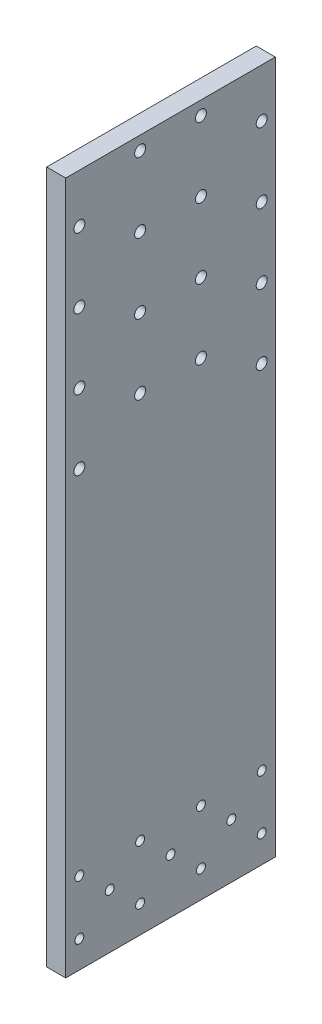
ISO-10303-21;
HEADER;
FILE_DESCRIPTION(('STEP AP214'),'2;1');
FILE_NAME('part.step','',(''),(''),'','','');
FILE_SCHEMA(('AUTOMOTIVE_DESIGN { 1 0 10303 214 1 1 1 1 }'));
ENDSEC;
DATA;
#1=APPLICATION_CONTEXT('core data for automotive mechanical design processes');
#2=APPLICATION_PROTOCOL_DEFINITION('international standard','automotive_design',2000,#1);
#3=PRODUCT_CONTEXT('',#1,'mechanical');
#4=PRODUCT('Part','Part','',(#3));
#5=PRODUCT_RELATED_PRODUCT_CATEGORY('part','',(#4));
#6=PRODUCT_DEFINITION_FORMATION('','',#4);
#7=PRODUCT_DEFINITION_CONTEXT('part definition',#1,'design');
#8=PRODUCT_DEFINITION('design','',#6,#7);
#9=PRODUCT_DEFINITION_SHAPE('','',#8);
#10=(LENGTH_UNIT() NAMED_UNIT(*) SI_UNIT(.MILLI.,.METRE.));
#11=(NAMED_UNIT(*) PLANE_ANGLE_UNIT() SI_UNIT($,.RADIAN.));
#12=(NAMED_UNIT(*) SI_UNIT($,.STERADIAN.) SOLID_ANGLE_UNIT());
#13=UNCERTAINTY_MEASURE_WITH_UNIT(LENGTH_MEASURE(1.E-05),#10,'distance_accuracy_value','');
#14=(GEOMETRIC_REPRESENTATION_CONTEXT(3) GLOBAL_UNCERTAINTY_ASSIGNED_CONTEXT((#13)) GLOBAL_UNIT_ASSIGNED_CONTEXT((#10,
#11,#12)) REPRESENTATION_CONTEXT('',''));
#15=CARTESIAN_POINT('',(0.,0.,0.));
#16=DIRECTION('',(0.,0.,1.));
#17=DIRECTION('',(1.,0.,0.));
#18=AXIS2_PLACEMENT_3D('',#15,#16,#17);
#19=CARTESIAN_POINT('',(-12.5,213.75,-1.27227411932373));
#20=DIRECTION('',(0.,1.,0.));
#21=DIRECTION('',(1.,0.,0.));
#22=AXIS2_PLACEMENT_3D('',#19,#20,#21);
#23=PLANE('',#22);
#24=DIRECTION('',(0.,0.,1.));
#25=VECTOR('',#24,1.);
#26=CARTESIAN_POINT('',(3.5,213.75,0.));
#27=LINE('',#26,#25);
#28=CARTESIAN_POINT('',(3.5,213.75,-38.5));
#29=VERTEX_POINT('',#28);
#30=CARTESIAN_POINT('',(3.5,213.75,38.5));
#31=VERTEX_POINT('',#30);
#32=EDGE_CURVE('E347',#29,#31,#27,.T.);
#33=ORIENTED_EDGE('',*,*,#32,.T.);
#34=DIRECTION('',(-1.,0.,0.));
#35=VECTOR('',#34,1.);
#36=CARTESIAN_POINT('',(3.5,213.75,38.5));
#37=LINE('',#36,#35);
#38=CARTESIAN_POINT('',(-3.5,213.75,38.5));
#39=VERTEX_POINT('',#38);
#40=EDGE_CURVE('E27',#31,#39,#37,.T.);
#41=ORIENTED_EDGE('',*,*,#40,.T.);
#42=DIRECTION('',(0.,0.,1.));
#43=VECTOR('',#42,1.);
#44=CARTESIAN_POINT('',(-3.5,213.75,0.));
#45=LINE('',#44,#43);
#46=CARTESIAN_POINT('',(-3.5,213.75,-38.5));
#47=VERTEX_POINT('',#46);
#48=EDGE_CURVE('E420',#47,#39,#45,.T.);
#49=ORIENTED_EDGE('',*,*,#48,.F.);
#50=DIRECTION('',(1.,0.,0.));
#51=VECTOR('',#50,1.);
#52=CARTESIAN_POINT('',(3.5,213.75,-38.5));
#53=LINE('',#52,#51);
#54=EDGE_CURVE('E11',#47,#29,#53,.T.);
#55=ORIENTED_EDGE('',*,*,#54,.T.);
#56=EDGE_LOOP('',(#33,#41,#49,#55));
#57=FACE_BOUND('',#56,.T.);
#58=ADVANCED_FACE('F16',(#57),#23,.F.);
#59=CARTESIAN_POINT('',(3.5,233.75,-38.5));
#60=DIRECTION('',(0.,0.,-1.));
#61=DIRECTION('',(-1.,0.,0.));
#62=AXIS2_PLACEMENT_3D('',#59,#60,#61);
#63=PLANE('',#62);
#64=ORIENTED_EDGE('',*,*,#54,.F.);
#65=DIRECTION('',(0.,-1.,0.));
#66=VECTOR('',#65,1.);
#67=CARTESIAN_POINT('',(-3.5,233.75,-38.5));
#68=LINE('',#67,#66);
#69=CARTESIAN_POINT('',(-3.5,468.25,-38.5));
#70=VERTEX_POINT('',#69);
#71=EDGE_CURVE('E333',#70,#47,#68,.T.);
#72=ORIENTED_EDGE('',*,*,#71,.F.);
#73=DIRECTION('',(-1.,0.,0.));
#74=VECTOR('',#73,1.);
#75=CARTESIAN_POINT('',(3.5,468.25,-38.5));
#76=LINE('',#75,#74);
#77=CARTESIAN_POINT('',(3.5,468.25,-38.5));
#78=VERTEX_POINT('',#77);
#79=EDGE_CURVE('E329',#78,#70,#76,.T.);
#80=ORIENTED_EDGE('',*,*,#79,.F.);
#81=DIRECTION('',(0.,-1.,0.));
#82=VECTOR('',#81,1.);
#83=CARTESIAN_POINT('',(3.5,233.75,-38.5));
#84=LINE('',#83,#82);
#85=EDGE_CURVE('E312',#78,#29,#84,.T.);
#86=ORIENTED_EDGE('',*,*,#85,.T.);
#87=EDGE_LOOP('',(#64,#72,#80,#86));
#88=FACE_BOUND('',#87,.T.);
#89=ADVANCED_FACE('F424',(#88),#63,.T.);
#90=CARTESIAN_POINT('',(3.5,233.75,38.5));
#91=DIRECTION('',(0.,0.,1.));
#92=DIRECTION('',(1.,0.,0.));
#93=AXIS2_PLACEMENT_3D('',#90,#91,#92);
#94=PLANE('',#93);
#95=ORIENTED_EDGE('',*,*,#40,.F.);
#96=DIRECTION('',(0.,1.,0.));
#97=VECTOR('',#96,1.);
#98=CARTESIAN_POINT('',(3.5,233.75,38.5));
#99=LINE('',#98,#97);
#100=CARTESIAN_POINT('',(3.5,468.25,38.5));
#101=VERTEX_POINT('',#100);
#102=EDGE_CURVE('E309',#31,#101,#99,.T.);
#103=ORIENTED_EDGE('',*,*,#102,.T.);
#104=DIRECTION('',(-1.,0.,0.));
#105=VECTOR('',#104,1.);
#106=CARTESIAN_POINT('',(3.5,468.25,38.5));
#107=LINE('',#106,#105);
#108=CARTESIAN_POINT('',(-3.5,468.25,38.5));
#109=VERTEX_POINT('',#108);
#110=EDGE_CURVE('E368',#101,#109,#107,.T.);
#111=ORIENTED_EDGE('',*,*,#110,.T.);
#112=DIRECTION('',(0.,1.,0.));
#113=VECTOR('',#112,1.);
#114=CARTESIAN_POINT('',(-3.5,233.75,38.5));
#115=LINE('',#114,#113);
#116=EDGE_CURVE('E351',#39,#109,#115,.T.);
#117=ORIENTED_EDGE('',*,*,#116,.F.);
#118=EDGE_LOOP('',(#95,#103,#111,#117));
#119=FACE_BOUND('',#118,.T.);
#120=ADVANCED_FACE('F388',(#119),#94,.T.);
#121=CARTESIAN_POINT('',(3.5,214.875,0.));
#122=DIRECTION('',(1.,0.,0.));
#123=DIRECTION('',(0.,1.,0.));
#124=AXIS2_PLACEMENT_3D('',#121,#122,#123);
#125=PLANE('',#124);
#126=CARTESIAN_POINT('',(3.5,373.25,-33.5));
#127=DIRECTION('',(-1.,0.,0.));
#128=DIRECTION('',(0.,0.,-1.));
#129=AXIS2_PLACEMENT_3D('',#126,#127,#128);
#130=CIRCLE('',#129,2.025);
#131=CARTESIAN_POINT('',(3.5,373.25,-35.525));
#132=VERTEX_POINT('',#131);
#133=EDGE_CURVE('E439',#132,#132,#130,.T.);
#134=ORIENTED_EDGE('',*,*,#133,.T.);
#135=EDGE_LOOP('',(#134));
#136=FACE_BOUND('',#135,.T.);
#137=CARTESIAN_POINT('',(3.5,450.392857142857,33.5));
#138=DIRECTION('',(-1.,0.,0.));
#139=DIRECTION('',(0.,0.,-1.));
#140=AXIS2_PLACEMENT_3D('',#137,#138,#139);
#141=CIRCLE('',#140,2.025);
#142=CARTESIAN_POINT('',(3.5,450.392857142857,31.475));
#143=VERTEX_POINT('',#142);
#144=EDGE_CURVE('E372',#143,#143,#141,.T.);
#145=ORIENTED_EDGE('',*,*,#144,.T.);
#146=EDGE_LOOP('',(#145));
#147=FACE_BOUND('',#146,.T.);
#148=CARTESIAN_POINT('',(3.5,424.678571428572,-33.5));
#149=DIRECTION('',(1.,0.,0.));
#150=DIRECTION('',(0.,0.,-1.));
#151=AXIS2_PLACEMENT_3D('',#148,#149,#150);
#152=CIRCLE('',#151,2.025);
#153=CARTESIAN_POINT('',(3.5,424.678571428572,-35.525));
#154=VERTEX_POINT('',#153);
#155=EDGE_CURVE('E298',#154,#154,#152,.T.);
#156=ORIENTED_EDGE('',*,*,#155,.F.);
#157=EDGE_LOOP('',(#156));
#158=FACE_BOUND('',#157,.T.);
#159=CARTESIAN_POINT('',(3.5,450.392857142857,-33.5));
#160=DIRECTION('',(1.,0.,0.));
#161=DIRECTION('',(0.,0.,-1.));
#162=AXIS2_PLACEMENT_3D('',#159,#160,#161);
#163=CIRCLE('',#162,2.025);
#164=CARTESIAN_POINT('',(3.5,450.392857142857,-35.525));
#165=VERTEX_POINT('',#164);
#166=EDGE_CURVE('E297',#165,#165,#163,.T.);
#167=ORIENTED_EDGE('',*,*,#166,.F.);
#168=EDGE_LOOP('',(#167));
#169=FACE_BOUND('',#168,.T.);
#170=CARTESIAN_POINT('',(3.5,437.535714285715,-11.1666666666667));
#171=DIRECTION('',(-1.,0.,0.));
#172=DIRECTION('',(0.,0.,-1.));
#173=AXIS2_PLACEMENT_3D('',#170,#171,#172);
#174=CIRCLE('',#173,2.025);
#175=CARTESIAN_POINT('',(3.5,437.535714285715,-13.1916666666667));
#176=VERTEX_POINT('',#175);
#177=EDGE_CURVE('E324',#176,#176,#174,.T.);
#178=ORIENTED_EDGE('',*,*,#177,.T.);
#179=EDGE_LOOP('',(#178));
#180=FACE_BOUND('',#179,.T.);
#181=CARTESIAN_POINT('',(3.5,411.821428571429,-11.1666666666667));
#182=DIRECTION('',(1.,0.,0.));
#183=DIRECTION('',(0.,0.,-1.));
#184=AXIS2_PLACEMENT_3D('',#181,#182,#183);
#185=CIRCLE('',#184,2.025);
#186=CARTESIAN_POINT('',(3.5,411.821428571429,-13.1916666666667));
#187=VERTEX_POINT('',#186);
#188=EDGE_CURVE('E261',#187,#187,#185,.T.);
#189=ORIENTED_EDGE('',*,*,#188,.F.);
#190=EDGE_LOOP('',(#189));
#191=FACE_BOUND('',#190,.T.);
#192=CARTESIAN_POINT('',(3.5,386.107142857143,-11.1666666666667));
#193=DIRECTION('',(1.,0.,0.));
#194=DIRECTION('',(0.,0.,-1.));
#195=AXIS2_PLACEMENT_3D('',#192,#193,#194);
#196=CIRCLE('',#195,2.025);
#197=CARTESIAN_POINT('',(3.5,386.107142857143,-13.1916666666667));
#198=VERTEX_POINT('',#197);
#199=EDGE_CURVE('E20',#198,#198,#196,.T.);
#200=ORIENTED_EDGE('',*,*,#199,.F.);
#201=EDGE_LOOP('',(#200));
#202=FACE_BOUND('',#201,.T.);
#203=CARTESIAN_POINT('',(3.5,463.25,11.1666666666667));
#204=DIRECTION('',(1.,0.,0.));
#205=DIRECTION('',(0.,0.,-1.));
#206=AXIS2_PLACEMENT_3D('',#203,#204,#205);
#207=CIRCLE('',#206,2.025);
#208=CARTESIAN_POINT('',(3.5,463.25,9.14166666666666));
#209=VERTEX_POINT('',#208);
#210=EDGE_CURVE('E270',#209,#209,#207,.T.);
#211=ORIENTED_EDGE('',*,*,#210,.F.);
#212=EDGE_LOOP('',(#211));
#213=FACE_BOUND('',#212,.T.);
#214=CARTESIAN_POINT('',(3.5,437.535714285715,11.1666666666667));
#215=DIRECTION('',(1.,0.,0.));
#216=DIRECTION('',(0.,0.,-1.));
#217=AXIS2_PLACEMENT_3D('',#214,#215,#216);
#218=CIRCLE('',#217,2.025);
#219=CARTESIAN_POINT('',(3.5,437.535714285715,9.14166666666666));
#220=VERTEX_POINT('',#219);
#221=EDGE_CURVE('E461',#220,#220,#218,.T.);
#222=ORIENTED_EDGE('',*,*,#221,.F.);
#223=EDGE_LOOP('',(#222));
#224=FACE_BOUND('',#223,.T.);
#225=CARTESIAN_POINT('',(3.5,386.107142857143,11.1666666666667));
#226=DIRECTION('',(-1.,0.,0.));
#227=DIRECTION('',(0.,0.,-1.));
#228=AXIS2_PLACEMENT_3D('',#225,#226,#227);
#229=CIRCLE('',#228,2.025);
#230=CARTESIAN_POINT('',(3.5,386.107142857143,9.14166666666666));
#231=VERTEX_POINT('',#230);
#232=EDGE_CURVE('E299',#231,#231,#229,.T.);
#233=ORIENTED_EDGE('',*,*,#232,.T.);
#234=EDGE_LOOP('',(#233));
#235=FACE_BOUND('',#234,.T.);
#236=CARTESIAN_POINT('',(3.5,411.821428571429,11.1666666666667));
#237=DIRECTION('',(-1.,0.,0.));
#238=DIRECTION('',(0.,0.,-1.));
#239=AXIS2_PLACEMENT_3D('',#236,#237,#238);
#240=CIRCLE('',#239,2.025);
#241=CARTESIAN_POINT('',(3.5,411.821428571429,9.14166666666666));
#242=VERTEX_POINT('',#241);
#243=EDGE_CURVE('E444',#242,#242,#240,.T.);
#244=ORIENTED_EDGE('',*,*,#243,.T.);
#245=EDGE_LOOP('',(#244));
#246=FACE_BOUND('',#245,.T.);
#247=CARTESIAN_POINT('',(3.5,463.25,-11.1666666666667));
#248=DIRECTION('',(-1.,0.,0.));
#249=DIRECTION('',(0.,0.,-1.));
#250=AXIS2_PLACEMENT_3D('',#247,#248,#249);
#251=CIRCLE('',#250,2.025);
#252=CARTESIAN_POINT('',(3.5,463.25,-13.1916666666667));
#253=VERTEX_POINT('',#252);
#254=EDGE_CURVE('E335',#253,#253,#251,.T.);
#255=ORIENTED_EDGE('',*,*,#254,.T.);
#256=EDGE_LOOP('',(#255));
#257=FACE_BOUND('',#256,.T.);
#258=CARTESIAN_POINT('',(3.5,424.678571428572,33.5));
#259=DIRECTION('',(-1.,0.,0.));
#260=DIRECTION('',(0.,0.,-1.));
#261=AXIS2_PLACEMENT_3D('',#258,#259,#260);
#262=CIRCLE('',#261,2.025);
#263=CARTESIAN_POINT('',(3.5,424.678571428572,31.475));
#264=VERTEX_POINT('',#263);
#265=EDGE_CURVE('E183',#264,#264,#262,.T.);
#266=ORIENTED_EDGE('',*,*,#265,.T.);
#267=EDGE_LOOP('',(#266));
#268=FACE_BOUND('',#267,.T.);
#269=CARTESIAN_POINT('',(3.5,398.964285714285,-33.5));
#270=DIRECTION('',(-1.,0.,0.));
#271=DIRECTION('',(0.,0.,-1.));
#272=AXIS2_PLACEMENT_3D('',#269,#270,#271);
#273=CIRCLE('',#272,2.025);
#274=CARTESIAN_POINT('',(3.5,398.964285714285,-35.525));
#275=VERTEX_POINT('',#274);
#276=EDGE_CURVE('E367',#275,#275,#273,.T.);
#277=ORIENTED_EDGE('',*,*,#276,.T.);
#278=EDGE_LOOP('',(#277));
#279=FACE_BOUND('',#278,.T.);
#280=CARTESIAN_POINT('',(3.5,373.25,33.5));
#281=DIRECTION('',(1.,0.,0.));
#282=DIRECTION('',(0.,0.,-1.));
#283=AXIS2_PLACEMENT_3D('',#280,#281,#282);
#284=CIRCLE('',#283,2.025);
#285=CARTESIAN_POINT('',(3.5,373.25,31.475));
#286=VERTEX_POINT('',#285);
#287=EDGE_CURVE('E304',#286,#286,#284,.T.);
#288=ORIENTED_EDGE('',*,*,#287,.F.);
#289=EDGE_LOOP('',(#288));
#290=FACE_BOUND('',#289,.T.);
#291=CARTESIAN_POINT('',(3.5,398.964285714285,33.5));
#292=DIRECTION('',(1.,0.,0.));
#293=DIRECTION('',(0.,0.,-1.));
#294=AXIS2_PLACEMENT_3D('',#291,#292,#293);
#295=CIRCLE('',#294,2.025);
#296=CARTESIAN_POINT('',(3.5,398.964285714285,31.475));
#297=VERTEX_POINT('',#296);
#298=EDGE_CURVE('E315',#297,#297,#295,.T.);
#299=ORIENTED_EDGE('',*,*,#298,.F.);
#300=EDGE_LOOP('',(#299));
#301=FACE_BOUND('',#300,.T.);
#302=CARTESIAN_POINT('',(3.5,233.75,0.));
#303=DIRECTION('',(-1.,0.,0.));
#304=DIRECTION('',(0.,0.,-1.));
#305=AXIS2_PLACEMENT_3D('',#302,#303,#304);
#306=CIRCLE('',#305,1.65);
#307=CARTESIAN_POINT('',(3.5,233.75,-1.65));
#308=VERTEX_POINT('',#307);
#309=EDGE_CURVE('E293',#308,#308,#306,.T.);
#310=ORIENTED_EDGE('',*,*,#309,.T.);
#311=EDGE_LOOP('',(#310));
#312=FACE_BOUND('',#311,.T.);
#313=CARTESIAN_POINT('',(3.5,243.75,-33.5));
#314=DIRECTION('',(-1.,0.,0.));
#315=DIRECTION('',(0.,0.,-1.));
#316=AXIS2_PLACEMENT_3D('',#313,#314,#315);
#317=CIRCLE('',#316,1.65);
#318=CARTESIAN_POINT('',(3.5,243.75,-35.15));
#319=VERTEX_POINT('',#318);
#320=EDGE_CURVE('E292',#319,#319,#317,.T.);
#321=ORIENTED_EDGE('',*,*,#320,.T.);
#322=EDGE_LOOP('',(#321));
#323=FACE_BOUND('',#322,.T.);
#324=CARTESIAN_POINT('',(3.5,243.75,11.1666666666667));
#325=DIRECTION('',(-1.,0.,0.));
#326=DIRECTION('',(0.,0.,-1.));
#327=AXIS2_PLACEMENT_3D('',#324,#325,#326);
#328=CIRCLE('',#327,1.65);
#329=CARTESIAN_POINT('',(3.5,243.75,9.51666666666666));
#330=VERTEX_POINT('',#329);
#331=EDGE_CURVE('E320',#330,#330,#328,.T.);
#332=ORIENTED_EDGE('',*,*,#331,.T.);
#333=EDGE_LOOP('',(#332));
#334=FACE_BOUND('',#333,.T.);
#335=CARTESIAN_POINT('',(3.5,223.75,-33.5));
#336=DIRECTION('',(1.,0.,0.));
#337=DIRECTION('',(0.,0.,-1.));
#338=AXIS2_PLACEMENT_3D('',#335,#336,#337);
#339=CIRCLE('',#338,1.65);
#340=CARTESIAN_POINT('',(3.5,223.75,-35.15));
#341=VERTEX_POINT('',#340);
#342=EDGE_CURVE('E319',#341,#341,#339,.T.);
#343=ORIENTED_EDGE('',*,*,#342,.F.);
#344=EDGE_LOOP('',(#343));
#345=FACE_BOUND('',#344,.T.);
#346=CARTESIAN_POINT('',(3.5,223.75,-11.1666666666667));
#347=DIRECTION('',(1.,0.,0.));
#348=DIRECTION('',(0.,0.,-1.));
#349=AXIS2_PLACEMENT_3D('',#346,#347,#348);
#350=CIRCLE('',#349,1.65);
#351=CARTESIAN_POINT('',(3.5,223.75,-12.8166666666667));
#352=VERTEX_POINT('',#351);
#353=EDGE_CURVE('E275',#352,#352,#350,.T.);
#354=ORIENTED_EDGE('',*,*,#353,.F.);
#355=EDGE_LOOP('',(#354));
#356=FACE_BOUND('',#355,.T.);
#357=CARTESIAN_POINT('',(3.5,223.75,11.1666666666667));
#358=DIRECTION('',(1.,0.,0.));
#359=DIRECTION('',(0.,0.,-1.));
#360=AXIS2_PLACEMENT_3D('',#357,#358,#359);
#361=CIRCLE('',#360,1.65);
#362=CARTESIAN_POINT('',(3.5,223.75,9.51666666666666));
#363=VERTEX_POINT('',#362);
#364=EDGE_CURVE('E274',#363,#363,#361,.T.);
#365=ORIENTED_EDGE('',*,*,#364,.F.);
#366=EDGE_LOOP('',(#365));
#367=FACE_BOUND('',#366,.T.);
#368=CARTESIAN_POINT('',(3.5,223.75,33.5));
#369=DIRECTION('',(1.,0.,0.));
#370=DIRECTION('',(0.,0.,-1.));
#371=AXIS2_PLACEMENT_3D('',#368,#369,#370);
#372=CIRCLE('',#371,1.65);
#373=CARTESIAN_POINT('',(3.5,223.75,31.85));
#374=VERTEX_POINT('',#373);
#375=EDGE_CURVE('E288',#374,#374,#372,.T.);
#376=ORIENTED_EDGE('',*,*,#375,.F.);
#377=EDGE_LOOP('',(#376));
#378=FACE_BOUND('',#377,.T.);
#379=CARTESIAN_POINT('',(3.5,243.75,33.5));
#380=DIRECTION('',(-1.,0.,0.));
#381=DIRECTION('',(0.,0.,-1.));
#382=AXIS2_PLACEMENT_3D('',#379,#380,#381);
#383=CIRCLE('',#382,1.65);
#384=CARTESIAN_POINT('',(3.5,243.75,31.85));
#385=VERTEX_POINT('',#384);
#386=EDGE_CURVE('E283',#385,#385,#383,.T.);
#387=ORIENTED_EDGE('',*,*,#386,.T.);
#388=EDGE_LOOP('',(#387));
#389=FACE_BOUND('',#388,.T.);
#390=CARTESIAN_POINT('',(3.5,243.75,-11.1666666666667));
#391=DIRECTION('',(-1.,0.,0.));
#392=DIRECTION('',(0.,0.,-1.));
#393=AXIS2_PLACEMENT_3D('',#390,#391,#392);
#394=CIRCLE('',#393,1.65);
#395=CARTESIAN_POINT('',(3.5,243.75,-12.8166666666667));
#396=VERTEX_POINT('',#395);
#397=EDGE_CURVE('E282',#396,#396,#394,.T.);
#398=ORIENTED_EDGE('',*,*,#397,.T.);
#399=EDGE_LOOP('',(#398));
#400=FACE_BOUND('',#399,.T.);
#401=CARTESIAN_POINT('',(3.5,233.75,-22.3333333333334));
#402=DIRECTION('',(-1.,0.,0.));
#403=DIRECTION('',(0.,0.,-1.));
#404=AXIS2_PLACEMENT_3D('',#401,#402,#403);
#405=CIRCLE('',#404,1.65);
#406=CARTESIAN_POINT('',(3.5,233.75,-23.9833333333334));
#407=VERTEX_POINT('',#406);
#408=EDGE_CURVE('E246',#407,#407,#405,.T.);
#409=ORIENTED_EDGE('',*,*,#408,.T.);
#410=EDGE_LOOP('',(#409));
#411=FACE_BOUND('',#410,.T.);
#412=CARTESIAN_POINT('',(3.5,233.75,22.3333333333334));
#413=DIRECTION('',(-1.,0.,0.));
#414=DIRECTION('',(0.,0.,-1.));
#415=AXIS2_PLACEMENT_3D('',#412,#413,#414);
#416=CIRCLE('',#415,1.65);
#417=CARTESIAN_POINT('',(3.5,233.75,20.6833333333334));
#418=VERTEX_POINT('',#417);
#419=EDGE_CURVE('E245',#418,#418,#416,.T.);
#420=ORIENTED_EDGE('',*,*,#419,.T.);
#421=EDGE_LOOP('',(#420));
#422=FACE_BOUND('',#421,.T.);
#423=ORIENTED_EDGE('',*,*,#32,.F.);
#424=ORIENTED_EDGE('',*,*,#85,.F.);
#425=DIRECTION('',(0.,0.,-1.));
#426=VECTOR('',#425,1.);
#427=CARTESIAN_POINT('',(3.5,468.25,0.));
#428=LINE('',#427,#426);
#429=EDGE_CURVE('E334',#101,#78,#428,.T.);
#430=ORIENTED_EDGE('',*,*,#429,.F.);
#431=ORIENTED_EDGE('',*,*,#102,.F.);
#432=EDGE_LOOP('',(#423,#424,#430,#431));
#433=FACE_BOUND('',#432,.T.);
#434=ADVANCED_FACE('F385',(#136,#147,#158,#169,#180,#191,#202,#213,#224,#235,#246,#257,#268,
#279,#290,#301,#312,#323,#334,#345,#356,#367,#378,#389,#400,#411,#422,#433),#125,.T.);
#435=CARTESIAN_POINT('',(-3.5,214.875,0.));
#436=DIRECTION('',(1.,0.,0.));
#437=DIRECTION('',(0.,1.,0.));
#438=AXIS2_PLACEMENT_3D('',#435,#436,#437);
#439=PLANE('',#438);
#440=CARTESIAN_POINT('',(-3.5,373.25,-33.5));
#441=DIRECTION('',(-1.,0.,0.));
#442=DIRECTION('',(0.,0.,-1.));
#443=AXIS2_PLACEMENT_3D('',#440,#441,#442);
#444=CIRCLE('',#443,2.025);
#445=CARTESIAN_POINT('',(-3.5,373.25,-35.525));
#446=VERTEX_POINT('',#445);
#447=EDGE_CURVE('E374',#446,#446,#444,.T.);
#448=ORIENTED_EDGE('',*,*,#447,.F.);
#449=EDGE_LOOP('',(#448));
#450=FACE_BOUND('',#449,.T.);
#451=CARTESIAN_POINT('',(-3.5,450.392857142857,33.5));
#452=DIRECTION('',(-1.,0.,0.));
#453=DIRECTION('',(0.,0.,-1.));
#454=AXIS2_PLACEMENT_3D('',#451,#452,#453);
#455=CIRCLE('',#454,2.025);
#456=CARTESIAN_POINT('',(-3.5,450.392857142857,31.475));
#457=VERTEX_POINT('',#456);
#458=EDGE_CURVE('E358',#457,#457,#455,.T.);
#459=ORIENTED_EDGE('',*,*,#458,.F.);
#460=EDGE_LOOP('',(#459));
#461=FACE_BOUND('',#460,.T.);
#462=CARTESIAN_POINT('',(-3.5,424.678571428572,-33.5));
#463=DIRECTION('',(1.,0.,0.));
#464=DIRECTION('',(0.,0.,-1.));
#465=AXIS2_PLACEMENT_3D('',#462,#463,#464);
#466=CIRCLE('',#465,2.025);
#467=CARTESIAN_POINT('',(-3.5,424.678571428572,-35.525));
#468=VERTEX_POINT('',#467);
#469=EDGE_CURVE('E294',#468,#468,#466,.T.);
#470=ORIENTED_EDGE('',*,*,#469,.T.);
#471=EDGE_LOOP('',(#470));
#472=FACE_BOUND('',#471,.T.);
#473=CARTESIAN_POINT('',(-3.5,450.392857142857,-33.5));
#474=DIRECTION('',(1.,0.,0.));
#475=DIRECTION('',(0.,0.,-1.));
#476=AXIS2_PLACEMENT_3D('',#473,#474,#475);
#477=CIRCLE('',#476,2.025);
#478=CARTESIAN_POINT('',(-3.5,450.392857142857,-35.525));
#479=VERTEX_POINT('',#478);
#480=EDGE_CURVE('E321',#479,#479,#477,.T.);
#481=ORIENTED_EDGE('',*,*,#480,.T.);
#482=EDGE_LOOP('',(#481));
#483=FACE_BOUND('',#482,.T.);
#484=CARTESIAN_POINT('',(-3.5,437.535714285715,-11.1666666666667));
#485=DIRECTION('',(-1.,0.,0.));
#486=DIRECTION('',(0.,0.,-1.));
#487=AXIS2_PLACEMENT_3D('',#484,#485,#486);
#488=CIRCLE('',#487,2.025);
#489=CARTESIAN_POINT('',(-3.5,437.535714285715,-13.1916666666667));
#490=VERTEX_POINT('',#489);
#491=EDGE_CURVE('E265',#490,#490,#488,.T.);
#492=ORIENTED_EDGE('',*,*,#491,.F.);
#493=EDGE_LOOP('',(#492));
#494=FACE_BOUND('',#493,.T.);
#495=CARTESIAN_POINT('',(-3.5,411.821428571429,-11.1666666666667));
#496=DIRECTION('',(1.,0.,0.));
#497=DIRECTION('',(0.,0.,-1.));
#498=AXIS2_PLACEMENT_3D('',#495,#496,#497);
#499=CIRCLE('',#498,2.025);
#500=CARTESIAN_POINT('',(-3.5,411.821428571429,-13.1916666666667));
#501=VERTEX_POINT('',#500);
#502=EDGE_CURVE('E264',#501,#501,#499,.T.);
#503=ORIENTED_EDGE('',*,*,#502,.T.);
#504=EDGE_LOOP('',(#503));
#505=FACE_BOUND('',#504,.T.);
#506=CARTESIAN_POINT('',(-3.5,386.107142857143,-11.1666666666667));
#507=DIRECTION('',(1.,0.,0.));
#508=DIRECTION('',(0.,0.,-1.));
#509=AXIS2_PLACEMENT_3D('',#506,#507,#508);
#510=CIRCLE('',#509,2.025);
#511=CARTESIAN_POINT('',(-3.5,386.107142857143,-13.1916666666667));
#512=VERTEX_POINT('',#511);
#513=EDGE_CURVE('E266',#512,#512,#510,.T.);
#514=ORIENTED_EDGE('',*,*,#513,.T.);
#515=EDGE_LOOP('',(#514));
#516=FACE_BOUND('',#515,.T.);
#517=CARTESIAN_POINT('',(-3.5,463.25,11.1666666666667));
#518=DIRECTION('',(1.,0.,0.));
#519=DIRECTION('',(0.,0.,-1.));
#520=AXIS2_PLACEMENT_3D('',#517,#518,#519);
#521=CIRCLE('',#520,2.025);
#522=CARTESIAN_POINT('',(-3.5,463.25,9.14166666666666));
#523=VERTEX_POINT('',#522);
#524=EDGE_CURVE('E354',#523,#523,#521,.T.);
#525=ORIENTED_EDGE('',*,*,#524,.T.);
#526=EDGE_LOOP('',(#525));
#527=FACE_BOUND('',#526,.T.);
#528=CARTESIAN_POINT('',(-3.5,437.535714285715,11.1666666666667));
#529=DIRECTION('',(1.,0.,0.));
#530=DIRECTION('',(0.,0.,-1.));
#531=AXIS2_PLACEMENT_3D('',#528,#529,#530);
#532=CIRCLE('',#531,2.025);
#533=CARTESIAN_POINT('',(-3.5,437.535714285715,9.14166666666666));
#534=VERTEX_POINT('',#533);
#535=EDGE_CURVE('E303',#534,#534,#532,.T.);
#536=ORIENTED_EDGE('',*,*,#535,.T.);
#537=EDGE_LOOP('',(#536));
#538=FACE_BOUND('',#537,.T.);
#539=CARTESIAN_POINT('',(-3.5,386.107142857143,11.1666666666667));
#540=DIRECTION('',(-1.,0.,0.));
#541=DIRECTION('',(0.,0.,-1.));
#542=AXIS2_PLACEMENT_3D('',#539,#540,#541);
#543=CIRCLE('',#542,2.025);
#544=CARTESIAN_POINT('',(-3.5,386.107142857143,9.14166666666666));
#545=VERTEX_POINT('',#544);
#546=EDGE_CURVE('E302',#545,#545,#543,.T.);
#547=ORIENTED_EDGE('',*,*,#546,.F.);
#548=EDGE_LOOP('',(#547));
#549=FACE_BOUND('',#548,.T.);
#550=CARTESIAN_POINT('',(-3.5,411.821428571429,11.1666666666667));
#551=DIRECTION('',(-1.,0.,0.));
#552=DIRECTION('',(0.,0.,-1.));
#553=AXIS2_PLACEMENT_3D('',#550,#551,#552);
#554=CIRCLE('',#553,2.025);
#555=CARTESIAN_POINT('',(-3.5,411.821428571429,9.14166666666666));
#556=VERTEX_POINT('',#555);
#557=EDGE_CURVE('E339',#556,#556,#554,.T.);
#558=ORIENTED_EDGE('',*,*,#557,.F.);
#559=EDGE_LOOP('',(#558));
#560=FACE_BOUND('',#559,.T.);
#561=CARTESIAN_POINT('',(-3.5,463.25,-11.1666666666667));
#562=DIRECTION('',(-1.,0.,0.));
#563=DIRECTION('',(0.,0.,-1.));
#564=AXIS2_PLACEMENT_3D('',#561,#562,#563);
#565=CIRCLE('',#564,2.025);
#566=CARTESIAN_POINT('',(-3.5,463.25,-13.1916666666667));
#567=VERTEX_POINT('',#566);
#568=EDGE_CURVE('E278',#567,#567,#565,.T.);
#569=ORIENTED_EDGE('',*,*,#568,.F.);
#570=EDGE_LOOP('',(#569));
#571=FACE_BOUND('',#570,.T.);
#572=CARTESIAN_POINT('',(-3.5,424.678571428572,33.5));
#573=DIRECTION('',(-1.,0.,0.));
#574=DIRECTION('',(0.,0.,-1.));
#575=AXIS2_PLACEMENT_3D('',#572,#573,#574);
#576=CIRCLE('',#575,2.025);
#577=CARTESIAN_POINT('',(-3.5,424.678571428572,31.475));
#578=VERTEX_POINT('',#577);
#579=EDGE_CURVE('E174',#578,#578,#576,.T.);
#580=ORIENTED_EDGE('',*,*,#579,.F.);
#581=EDGE_LOOP('',(#580));
#582=FACE_BOUND('',#581,.T.);
#583=CARTESIAN_POINT('',(-3.5,398.964285714285,-33.5));
#584=DIRECTION('',(-1.,0.,0.));
#585=DIRECTION('',(0.,0.,-1.));
#586=AXIS2_PLACEMENT_3D('',#583,#584,#585);
#587=CIRCLE('',#586,2.025);
#588=CARTESIAN_POINT('',(-3.5,398.964285714285,-35.525));
#589=VERTEX_POINT('',#588);
#590=EDGE_CURVE('E308',#589,#589,#587,.T.);
#591=ORIENTED_EDGE('',*,*,#590,.F.);
#592=EDGE_LOOP('',(#591));
#593=FACE_BOUND('',#592,.T.);
#594=CARTESIAN_POINT('',(-3.5,373.25,33.5));
#595=DIRECTION('',(1.,0.,0.));
#596=DIRECTION('',(0.,0.,-1.));
#597=AXIS2_PLACEMENT_3D('',#594,#595,#596);
#598=CIRCLE('',#597,2.025);
#599=CARTESIAN_POINT('',(-3.5,373.25,31.475));
#600=VERTEX_POINT('',#599);
#601=EDGE_CURVE('E307',#600,#600,#598,.T.);
#602=ORIENTED_EDGE('',*,*,#601,.T.);
#603=EDGE_LOOP('',(#602));
#604=FACE_BOUND('',#603,.T.);
#605=CARTESIAN_POINT('',(-3.5,398.964285714285,33.5));
#606=DIRECTION('',(1.,0.,0.));
#607=DIRECTION('',(0.,0.,-1.));
#608=AXIS2_PLACEMENT_3D('',#605,#606,#607);
#609=CIRCLE('',#608,2.025);
#610=CARTESIAN_POINT('',(-3.5,398.964285714285,31.475));
#611=VERTEX_POINT('',#610);
#612=EDGE_CURVE('E344',#611,#611,#609,.T.);
#613=ORIENTED_EDGE('',*,*,#612,.T.);
#614=EDGE_LOOP('',(#613));
#615=FACE_BOUND('',#614,.T.);
#616=CARTESIAN_POINT('',(-3.5,233.75,0.));
#617=DIRECTION('',(-1.,0.,0.));
#618=DIRECTION('',(0.,0.,-1.));
#619=AXIS2_PLACEMENT_3D('',#616,#617,#618);
#620=CIRCLE('',#619,1.65);
#621=CARTESIAN_POINT('',(-3.5,233.75,-1.65));
#622=VERTEX_POINT('',#621);
#623=EDGE_CURVE('E289',#622,#622,#620,.T.);
#624=ORIENTED_EDGE('',*,*,#623,.F.);
#625=EDGE_LOOP('',(#624));
#626=FACE_BOUND('',#625,.T.);
#627=CARTESIAN_POINT('',(-3.5,243.75,-33.5));
#628=DIRECTION('',(-1.,0.,0.));
#629=DIRECTION('',(0.,0.,-1.));
#630=AXIS2_PLACEMENT_3D('',#627,#628,#629);
#631=CIRCLE('',#630,1.65);
#632=CARTESIAN_POINT('',(-3.5,243.75,-35.15));
#633=VERTEX_POINT('',#632);
#634=EDGE_CURVE('E450',#633,#633,#631,.T.);
#635=ORIENTED_EDGE('',*,*,#634,.F.);
#636=EDGE_LOOP('',(#635));
#637=FACE_BOUND('',#636,.T.);
#638=CARTESIAN_POINT('',(-3.5,243.75,11.1666666666667));
#639=DIRECTION('',(-1.,0.,0.));
#640=DIRECTION('',(0.,0.,-1.));
#641=AXIS2_PLACEMENT_3D('',#638,#639,#640);
#642=CIRCLE('',#641,1.65);
#643=CARTESIAN_POINT('',(-3.5,243.75,9.51666666666666));
#644=VERTEX_POINT('',#643);
#645=EDGE_CURVE('E316',#644,#644,#642,.T.);
#646=ORIENTED_EDGE('',*,*,#645,.F.);
#647=EDGE_LOOP('',(#646));
#648=FACE_BOUND('',#647,.T.);
#649=CARTESIAN_POINT('',(-3.5,223.75,-33.5));
#650=DIRECTION('',(1.,0.,0.));
#651=DIRECTION('',(0.,0.,-1.));
#652=AXIS2_PLACEMENT_3D('',#649,#650,#651);
#653=CIRCLE('',#652,1.65);
#654=CARTESIAN_POINT('',(-3.5,223.75,-35.15));
#655=VERTEX_POINT('',#654);
#656=EDGE_CURVE('E445',#655,#655,#653,.T.);
#657=ORIENTED_EDGE('',*,*,#656,.T.);
#658=EDGE_LOOP('',(#657));
#659=FACE_BOUND('',#658,.T.);
#660=CARTESIAN_POINT('',(-3.5,223.75,-11.1666666666667));
#661=DIRECTION('',(1.,0.,0.));
#662=DIRECTION('',(0.,0.,-1.));
#663=AXIS2_PLACEMENT_3D('',#660,#661,#662);
#664=CIRCLE('',#663,1.65);
#665=CARTESIAN_POINT('',(-3.5,223.75,-12.8166666666667));
#666=VERTEX_POINT('',#665);
#667=EDGE_CURVE('E271',#666,#666,#664,.T.);
#668=ORIENTED_EDGE('',*,*,#667,.T.);
#669=EDGE_LOOP('',(#668));
#670=FACE_BOUND('',#669,.T.);
#671=CARTESIAN_POINT('',(-3.5,223.75,11.1666666666667));
#672=DIRECTION('',(1.,0.,0.));
#673=DIRECTION('',(0.,0.,-1.));
#674=AXIS2_PLACEMENT_3D('',#671,#672,#673);
#675=CIRCLE('',#674,1.65);
#676=CARTESIAN_POINT('',(-3.5,223.75,9.51666666666666));
#677=VERTEX_POINT('',#676);
#678=EDGE_CURVE('E328',#677,#677,#675,.T.);
#679=ORIENTED_EDGE('',*,*,#678,.T.);
#680=EDGE_LOOP('',(#679));
#681=FACE_BOUND('',#680,.T.);
#682=CARTESIAN_POINT('',(-3.5,223.75,33.5));
#683=DIRECTION('',(1.,0.,0.));
#684=DIRECTION('',(0.,0.,-1.));
#685=AXIS2_PLACEMENT_3D('',#682,#683,#684);
#686=CIRCLE('',#685,1.65);
#687=CARTESIAN_POINT('',(-3.5,223.75,31.85));
#688=VERTEX_POINT('',#687);
#689=EDGE_CURVE('E284',#688,#688,#686,.T.);
#690=ORIENTED_EDGE('',*,*,#689,.T.);
#691=EDGE_LOOP('',(#690));
#692=FACE_BOUND('',#691,.T.);
#693=CARTESIAN_POINT('',(-3.5,243.75,33.5));
#694=DIRECTION('',(-1.,0.,0.));
#695=DIRECTION('',(0.,0.,-1.));
#696=AXIS2_PLACEMENT_3D('',#693,#694,#695);
#697=CIRCLE('',#696,1.65);
#698=CARTESIAN_POINT('',(-3.5,243.75,31.85));
#699=VERTEX_POINT('',#698);
#700=EDGE_CURVE('E279',#699,#699,#697,.T.);
#701=ORIENTED_EDGE('',*,*,#700,.F.);
#702=EDGE_LOOP('',(#701));
#703=FACE_BOUND('',#702,.T.);
#704=CARTESIAN_POINT('',(-3.5,243.75,-11.1666666666667));
#705=DIRECTION('',(-1.,0.,0.));
#706=DIRECTION('',(0.,0.,-1.));
#707=AXIS2_PLACEMENT_3D('',#704,#705,#706);
#708=CIRCLE('',#707,1.65);
#709=CARTESIAN_POINT('',(-3.5,243.75,-12.8166666666667));
#710=VERTEX_POINT('',#709);
#711=EDGE_CURVE('E256',#710,#710,#708,.T.);
#712=ORIENTED_EDGE('',*,*,#711,.F.);
#713=EDGE_LOOP('',(#712));
#714=FACE_BOUND('',#713,.T.);
#715=CARTESIAN_POINT('',(-3.5,233.75,-22.3333333333334));
#716=DIRECTION('',(-1.,0.,0.));
#717=DIRECTION('',(0.,0.,-1.));
#718=AXIS2_PLACEMENT_3D('',#715,#716,#717);
#719=CIRCLE('',#718,1.65);
#720=CARTESIAN_POINT('',(-3.5,233.75,-23.9833333333334));
#721=VERTEX_POINT('',#720);
#722=EDGE_CURVE('E240',#721,#721,#719,.T.);
#723=ORIENTED_EDGE('',*,*,#722,.F.);
#724=EDGE_LOOP('',(#723));
#725=FACE_BOUND('',#724,.T.);
#726=CARTESIAN_POINT('',(-3.5,233.75,22.3333333333334));
#727=DIRECTION('',(-1.,0.,0.));
#728=DIRECTION('',(0.,0.,-1.));
#729=AXIS2_PLACEMENT_3D('',#726,#727,#728);
#730=CIRCLE('',#729,1.65);
#731=CARTESIAN_POINT('',(-3.5,233.75,20.6833333333334));
#732=VERTEX_POINT('',#731);
#733=EDGE_CURVE('E253',#732,#732,#730,.T.);
#734=ORIENTED_EDGE('',*,*,#733,.F.);
#735=EDGE_LOOP('',(#734));
#736=FACE_BOUND('',#735,.T.);
#737=ORIENTED_EDGE('',*,*,#71,.T.);
#738=ORIENTED_EDGE('',*,*,#48,.T.);
#739=ORIENTED_EDGE('',*,*,#116,.T.);
#740=DIRECTION('',(0.,0.,-1.));
#741=VECTOR('',#740,1.);
#742=CARTESIAN_POINT('',(-3.5,468.25,0.));
#743=LINE('',#742,#741);
#744=EDGE_CURVE('E364',#109,#70,#743,.T.);
#745=ORIENTED_EDGE('',*,*,#744,.T.);
#746=EDGE_LOOP('',(#737,#738,#739,#745));
#747=FACE_BOUND('',#746,.T.);
#748=ADVANCED_FACE('F18',(#450,#461,#472,#483,#494,#505,#516,#527,#538,#549,#560,#571,#582,#593,
#604,#615,#626,#637,#648,#659,#670,#681,#692,#703,#714,#725,#736,#747),#439,.F.);
#749=CARTESIAN_POINT('',(3.5,468.25,0.));
#750=DIRECTION('',(0.,1.,0.));
#751=DIRECTION('',(1.,0.,0.));
#752=AXIS2_PLACEMENT_3D('',#749,#750,#751);
#753=PLANE('',#752);
#754=ORIENTED_EDGE('',*,*,#744,.F.);
#755=ORIENTED_EDGE('',*,*,#110,.F.);
#756=ORIENTED_EDGE('',*,*,#429,.T.);
#757=ORIENTED_EDGE('',*,*,#79,.T.);
#758=EDGE_LOOP('',(#754,#755,#756,#757));
#759=FACE_BOUND('',#758,.T.);
#760=ADVANCED_FACE('F581',(#759),#753,.T.);
#761=CARTESIAN_POINT('',(3.5,233.75,22.3333333333334));
#762=DIRECTION('',(-1.,0.,0.));
#763=DIRECTION('',(0.,0.,1.));
#764=AXIS2_PLACEMENT_3D('',#761,#762,#763);
#765=CYLINDRICAL_SURFACE('',#764,1.65);
#766=ORIENTED_EDGE('',*,*,#733,.T.);
#767=EDGE_LOOP('',(#766));
#768=FACE_BOUND('',#767,.T.);
#769=ORIENTED_EDGE('',*,*,#419,.F.);
#770=EDGE_LOOP('',(#769));
#771=FACE_BOUND('',#770,.T.);
#772=ADVANCED_FACE('F580',(#768,#771),#765,.F.);
#773=CARTESIAN_POINT('',(3.5,233.75,-22.3333333333334));
#774=DIRECTION('',(-1.,0.,0.));
#775=DIRECTION('',(0.,0.,1.));
#776=AXIS2_PLACEMENT_3D('',#773,#774,#775);
#777=CYLINDRICAL_SURFACE('',#776,1.65);
#778=ORIENTED_EDGE('',*,*,#722,.T.);
#779=EDGE_LOOP('',(#778));
#780=FACE_BOUND('',#779,.T.);
#781=ORIENTED_EDGE('',*,*,#408,.F.);
#782=EDGE_LOOP('',(#781));
#783=FACE_BOUND('',#782,.T.);
#784=ADVANCED_FACE('F241',(#780,#783),#777,.F.);
#785=CARTESIAN_POINT('',(3.5,243.75,-11.1666666666667));
#786=DIRECTION('',(-1.,0.,0.));
#787=DIRECTION('',(0.,0.,1.));
#788=AXIS2_PLACEMENT_3D('',#785,#786,#787);
#789=CYLINDRICAL_SURFACE('',#788,1.65);
#790=ORIENTED_EDGE('',*,*,#711,.T.);
#791=EDGE_LOOP('',(#790));
#792=FACE_BOUND('',#791,.T.);
#793=ORIENTED_EDGE('',*,*,#397,.F.);
#794=EDGE_LOOP('',(#793));
#795=FACE_BOUND('',#794,.T.);
#796=ADVANCED_FACE('F579',(#792,#795),#789,.F.);
#797=CARTESIAN_POINT('',(3.5,243.75,33.5));
#798=DIRECTION('',(-1.,0.,0.));
#799=DIRECTION('',(0.,0.,1.));
#800=AXIS2_PLACEMENT_3D('',#797,#798,#799);
#801=CYLINDRICAL_SURFACE('',#800,1.65);
#802=ORIENTED_EDGE('',*,*,#700,.T.);
#803=EDGE_LOOP('',(#802));
#804=FACE_BOUND('',#803,.T.);
#805=ORIENTED_EDGE('',*,*,#386,.F.);
#806=EDGE_LOOP('',(#805));
#807=FACE_BOUND('',#806,.T.);
#808=ADVANCED_FACE('F596',(#804,#807),#801,.F.);
#809=CARTESIAN_POINT('',(3.5,223.75,33.5));
#810=DIRECTION('',(-1.,0.,0.));
#811=DIRECTION('',(0.,0.,1.));
#812=AXIS2_PLACEMENT_3D('',#809,#810,#811);
#813=CYLINDRICAL_SURFACE('',#812,1.65);
#814=ORIENTED_EDGE('',*,*,#689,.F.);
#815=EDGE_LOOP('',(#814));
#816=FACE_BOUND('',#815,.T.);
#817=ORIENTED_EDGE('',*,*,#375,.T.);
#818=EDGE_LOOP('',(#817));
#819=FACE_BOUND('',#818,.T.);
#820=ADVANCED_FACE('F570',(#816,#819),#813,.F.);
#821=CARTESIAN_POINT('',(3.5,223.75,11.1666666666667));
#822=DIRECTION('',(-1.,0.,0.));
#823=DIRECTION('',(0.,0.,1.));
#824=AXIS2_PLACEMENT_3D('',#821,#822,#823);
#825=CYLINDRICAL_SURFACE('',#824,1.65);
#826=ORIENTED_EDGE('',*,*,#678,.F.);
#827=EDGE_LOOP('',(#826));
#828=FACE_BOUND('',#827,.T.);
#829=ORIENTED_EDGE('',*,*,#364,.T.);
#830=EDGE_LOOP('',(#829));
#831=FACE_BOUND('',#830,.T.);
#832=ADVANCED_FACE('F566',(#828,#831),#825,.F.);
#833=CARTESIAN_POINT('',(3.5,223.75,-11.1666666666667));
#834=DIRECTION('',(-1.,0.,0.));
#835=DIRECTION('',(0.,0.,1.));
#836=AXIS2_PLACEMENT_3D('',#833,#834,#835);
#837=CYLINDRICAL_SURFACE('',#836,1.65);
#838=ORIENTED_EDGE('',*,*,#667,.F.);
#839=EDGE_LOOP('',(#838));
#840=FACE_BOUND('',#839,.T.);
#841=ORIENTED_EDGE('',*,*,#353,.T.);
#842=EDGE_LOOP('',(#841));
#843=FACE_BOUND('',#842,.T.);
#844=ADVANCED_FACE('F569',(#840,#843),#837,.F.);
#845=CARTESIAN_POINT('',(3.5,223.75,-33.5));
#846=DIRECTION('',(-1.,0.,0.));
#847=DIRECTION('',(0.,0.,1.));
#848=AXIS2_PLACEMENT_3D('',#845,#846,#847);
#849=CYLINDRICAL_SURFACE('',#848,1.65);
#850=ORIENTED_EDGE('',*,*,#656,.F.);
#851=EDGE_LOOP('',(#850));
#852=FACE_BOUND('',#851,.T.);
#853=ORIENTED_EDGE('',*,*,#342,.T.);
#854=EDGE_LOOP('',(#853));
#855=FACE_BOUND('',#854,.T.);
#856=ADVANCED_FACE('F572',(#852,#855),#849,.F.);
#857=CARTESIAN_POINT('',(3.5,243.75,11.1666666666667));
#858=DIRECTION('',(-1.,0.,0.));
#859=DIRECTION('',(0.,0.,1.));
#860=AXIS2_PLACEMENT_3D('',#857,#858,#859);
#861=CYLINDRICAL_SURFACE('',#860,1.65);
#862=ORIENTED_EDGE('',*,*,#645,.T.);
#863=EDGE_LOOP('',(#862));
#864=FACE_BOUND('',#863,.T.);
#865=ORIENTED_EDGE('',*,*,#331,.F.);
#866=EDGE_LOOP('',(#865));
#867=FACE_BOUND('',#866,.T.);
#868=ADVANCED_FACE('F575',(#864,#867),#861,.F.);
#869=CARTESIAN_POINT('',(3.5,243.75,-33.5));
#870=DIRECTION('',(-1.,0.,0.));
#871=DIRECTION('',(0.,0.,1.));
#872=AXIS2_PLACEMENT_3D('',#869,#870,#871);
#873=CYLINDRICAL_SURFACE('',#872,1.65);
#874=ORIENTED_EDGE('',*,*,#634,.T.);
#875=EDGE_LOOP('',(#874));
#876=FACE_BOUND('',#875,.T.);
#877=ORIENTED_EDGE('',*,*,#320,.F.);
#878=EDGE_LOOP('',(#877));
#879=FACE_BOUND('',#878,.T.);
#880=ADVANCED_FACE('F602',(#876,#879),#873,.F.);
#881=CARTESIAN_POINT('',(3.5,233.75,0.));
#882=DIRECTION('',(-1.,0.,0.));
#883=DIRECTION('',(0.,0.,1.));
#884=AXIS2_PLACEMENT_3D('',#881,#882,#883);
#885=CYLINDRICAL_SURFACE('',#884,1.65);
#886=ORIENTED_EDGE('',*,*,#623,.T.);
#887=EDGE_LOOP('',(#886));
#888=FACE_BOUND('',#887,.T.);
#889=ORIENTED_EDGE('',*,*,#309,.F.);
#890=EDGE_LOOP('',(#889));
#891=FACE_BOUND('',#890,.T.);
#892=ADVANCED_FACE('F533',(#888,#891),#885,.F.);
#893=CARTESIAN_POINT('',(3.5,398.964285714285,33.5));
#894=DIRECTION('',(-1.,0.,0.));
#895=DIRECTION('',(0.,0.,1.));
#896=AXIS2_PLACEMENT_3D('',#893,#894,#895);
#897=CYLINDRICAL_SURFACE('',#896,2.025);
#898=ORIENTED_EDGE('',*,*,#612,.F.);
#899=EDGE_LOOP('',(#898));
#900=FACE_BOUND('',#899,.T.);
#901=ORIENTED_EDGE('',*,*,#298,.T.);
#902=EDGE_LOOP('',(#901));
#903=FACE_BOUND('',#902,.T.);
#904=ADVANCED_FACE('F383',(#900,#903),#897,.F.);
#905=CARTESIAN_POINT('',(3.5,373.25,33.5));
#906=DIRECTION('',(-1.,0.,0.));
#907=DIRECTION('',(0.,0.,1.));
#908=AXIS2_PLACEMENT_3D('',#905,#906,#907);
#909=CYLINDRICAL_SURFACE('',#908,2.025);
#910=ORIENTED_EDGE('',*,*,#601,.F.);
#911=EDGE_LOOP('',(#910));
#912=FACE_BOUND('',#911,.T.);
#913=ORIENTED_EDGE('',*,*,#287,.T.);
#914=EDGE_LOOP('',(#913));
#915=FACE_BOUND('',#914,.T.);
#916=ADVANCED_FACE('F521',(#912,#915),#909,.F.);
#917=CARTESIAN_POINT('',(3.5,398.964285714285,-33.5));
#918=DIRECTION('',(-1.,0.,0.));
#919=DIRECTION('',(0.,0.,1.));
#920=AXIS2_PLACEMENT_3D('',#917,#918,#919);
#921=CYLINDRICAL_SURFACE('',#920,2.025);
#922=ORIENTED_EDGE('',*,*,#590,.T.);
#923=EDGE_LOOP('',(#922));
#924=FACE_BOUND('',#923,.T.);
#925=ORIENTED_EDGE('',*,*,#276,.F.);
#926=EDGE_LOOP('',(#925));
#927=FACE_BOUND('',#926,.T.);
#928=ADVANCED_FACE('F523',(#924,#927),#921,.F.);
#929=CARTESIAN_POINT('',(3.5,424.678571428572,33.5));
#930=DIRECTION('',(-1.,0.,0.));
#931=DIRECTION('',(0.,0.,1.));
#932=AXIS2_PLACEMENT_3D('',#929,#930,#931);
#933=CYLINDRICAL_SURFACE('',#932,2.025);
#934=ORIENTED_EDGE('',*,*,#579,.T.);
#935=EDGE_LOOP('',(#934));
#936=FACE_BOUND('',#935,.T.);
#937=ORIENTED_EDGE('',*,*,#265,.F.);
#938=EDGE_LOOP('',(#937));
#939=FACE_BOUND('',#938,.T.);
#940=ADVANCED_FACE('F530',(#936,#939),#933,.F.);
#941=CARTESIAN_POINT('',(3.5,463.25,-11.1666666666667));
#942=DIRECTION('',(-1.,0.,0.));
#943=DIRECTION('',(0.,0.,1.));
#944=AXIS2_PLACEMENT_3D('',#941,#942,#943);
#945=CYLINDRICAL_SURFACE('',#944,2.025);
#946=ORIENTED_EDGE('',*,*,#568,.T.);
#947=EDGE_LOOP('',(#946));
#948=FACE_BOUND('',#947,.T.);
#949=ORIENTED_EDGE('',*,*,#254,.F.);
#950=EDGE_LOOP('',(#949));
#951=FACE_BOUND('',#950,.T.);
#952=ADVANCED_FACE('F592',(#948,#951),#945,.F.);
#953=CARTESIAN_POINT('',(3.5,411.821428571429,11.1666666666667));
#954=DIRECTION('',(-1.,0.,0.));
#955=DIRECTION('',(0.,0.,1.));
#956=AXIS2_PLACEMENT_3D('',#953,#954,#955);
#957=CYLINDRICAL_SURFACE('',#956,2.025);
#958=ORIENTED_EDGE('',*,*,#557,.T.);
#959=EDGE_LOOP('',(#958));
#960=FACE_BOUND('',#959,.T.);
#961=ORIENTED_EDGE('',*,*,#243,.F.);
#962=EDGE_LOOP('',(#961));
#963=FACE_BOUND('',#962,.T.);
#964=ADVANCED_FACE('F563',(#960,#963),#957,.F.);
#965=CARTESIAN_POINT('',(3.5,386.107142857143,11.1666666666667));
#966=DIRECTION('',(-1.,0.,0.));
#967=DIRECTION('',(0.,0.,1.));
#968=AXIS2_PLACEMENT_3D('',#965,#966,#967);
#969=CYLINDRICAL_SURFACE('',#968,2.025);
#970=ORIENTED_EDGE('',*,*,#546,.T.);
#971=EDGE_LOOP('',(#970));
#972=FACE_BOUND('',#971,.T.);
#973=ORIENTED_EDGE('',*,*,#232,.F.);
#974=EDGE_LOOP('',(#973));
#975=FACE_BOUND('',#974,.T.);
#976=ADVANCED_FACE('F506',(#972,#975),#969,.F.);
#977=CARTESIAN_POINT('',(3.5,437.535714285715,11.1666666666667));
#978=DIRECTION('',(-1.,0.,0.));
#979=DIRECTION('',(0.,0.,1.));
#980=AXIS2_PLACEMENT_3D('',#977,#978,#979);
#981=CYLINDRICAL_SURFACE('',#980,2.025);
#982=ORIENTED_EDGE('',*,*,#535,.F.);
#983=EDGE_LOOP('',(#982));
#984=FACE_BOUND('',#983,.T.);
#985=ORIENTED_EDGE('',*,*,#221,.T.);
#986=EDGE_LOOP('',(#985));
#987=FACE_BOUND('',#986,.T.);
#988=ADVANCED_FACE('F502',(#984,#987),#981,.F.);
#989=CARTESIAN_POINT('',(3.5,463.25,11.1666666666667));
#990=DIRECTION('',(-1.,0.,0.));
#991=DIRECTION('',(0.,0.,1.));
#992=AXIS2_PLACEMENT_3D('',#989,#990,#991);
#993=CYLINDRICAL_SURFACE('',#992,2.025);
#994=ORIENTED_EDGE('',*,*,#524,.F.);
#995=EDGE_LOOP('',(#994));
#996=FACE_BOUND('',#995,.T.);
#997=ORIENTED_EDGE('',*,*,#210,.T.);
#998=EDGE_LOOP('',(#997));
#999=FACE_BOUND('',#998,.T.);
#1000=ADVANCED_FACE('F505',(#996,#999),#993,.F.);
#1001=CARTESIAN_POINT('',(3.5,386.107142857143,-11.1666666666667));
#1002=DIRECTION('',(-1.,0.,0.));
#1003=DIRECTION('',(0.,0.,1.));
#1004=AXIS2_PLACEMENT_3D('',#1001,#1002,#1003);
#1005=CYLINDRICAL_SURFACE('',#1004,2.025);
#1006=ORIENTED_EDGE('',*,*,#513,.F.);
#1007=EDGE_LOOP('',(#1006));
#1008=FACE_BOUND('',#1007,.T.);
#1009=ORIENTED_EDGE('',*,*,#199,.T.);
#1010=EDGE_LOOP('',(#1009));
#1011=FACE_BOUND('',#1010,.T.);
#1012=ADVANCED_FACE('F553',(#1008,#1011),#1005,.F.);
#1013=CARTESIAN_POINT('',(3.5,411.821428571429,-11.1666666666667));
#1014=DIRECTION('',(-1.,0.,0.));
#1015=DIRECTION('',(0.,0.,1.));
#1016=AXIS2_PLACEMENT_3D('',#1013,#1014,#1015);
#1017=CYLINDRICAL_SURFACE('',#1016,2.025);
#1018=ORIENTED_EDGE('',*,*,#502,.F.);
#1019=EDGE_LOOP('',(#1018));
#1020=FACE_BOUND('',#1019,.T.);
#1021=ORIENTED_EDGE('',*,*,#188,.T.);
#1022=EDGE_LOOP('',(#1021));
#1023=FACE_BOUND('',#1022,.T.);
#1024=ADVANCED_FACE('F556',(#1020,#1023),#1017,.F.);
#1025=CARTESIAN_POINT('',(3.5,437.535714285715,-11.1666666666667));
#1026=DIRECTION('',(-1.,0.,0.));
#1027=DIRECTION('',(0.,0.,1.));
#1028=AXIS2_PLACEMENT_3D('',#1025,#1026,#1027);
#1029=CYLINDRICAL_SURFACE('',#1028,2.025);
#1030=ORIENTED_EDGE('',*,*,#491,.T.);
#1031=EDGE_LOOP('',(#1030));
#1032=FACE_BOUND('',#1031,.T.);
#1033=ORIENTED_EDGE('',*,*,#177,.F.);
#1034=EDGE_LOOP('',(#1033));
#1035=FACE_BOUND('',#1034,.T.);
#1036=ADVANCED_FACE('F560',(#1032,#1035),#1029,.F.);
#1037=CARTESIAN_POINT('',(3.5,450.392857142857,-33.5));
#1038=DIRECTION('',(-1.,0.,0.));
#1039=DIRECTION('',(0.,0.,1.));
#1040=AXIS2_PLACEMENT_3D('',#1037,#1038,#1039);
#1041=CYLINDRICAL_SURFACE('',#1040,2.025);
#1042=ORIENTED_EDGE('',*,*,#480,.F.);
#1043=EDGE_LOOP('',(#1042));
#1044=FACE_BOUND('',#1043,.T.);
#1045=ORIENTED_EDGE('',*,*,#166,.T.);
#1046=EDGE_LOOP('',(#1045));
#1047=FACE_BOUND('',#1046,.T.);
#1048=ADVANCED_FACE('F545',(#1044,#1047),#1041,.F.);
#1049=CARTESIAN_POINT('',(3.5,424.678571428572,-33.5));
#1050=DIRECTION('',(-1.,0.,0.));
#1051=DIRECTION('',(0.,0.,1.));
#1052=AXIS2_PLACEMENT_3D('',#1049,#1050,#1051);
#1053=CYLINDRICAL_SURFACE('',#1052,2.025);
#1054=ORIENTED_EDGE('',*,*,#469,.F.);
#1055=EDGE_LOOP('',(#1054));
#1056=FACE_BOUND('',#1055,.T.);
#1057=ORIENTED_EDGE('',*,*,#155,.T.);
#1058=EDGE_LOOP('',(#1057));
#1059=FACE_BOUND('',#1058,.T.);
#1060=ADVANCED_FACE('F589',(#1056,#1059),#1053,.F.);
#1061=CARTESIAN_POINT('',(3.5,450.392857142857,33.5));
#1062=DIRECTION('',(-1.,0.,0.));
#1063=DIRECTION('',(0.,0.,1.));
#1064=AXIS2_PLACEMENT_3D('',#1061,#1062,#1063);
#1065=CYLINDRICAL_SURFACE('',#1064,2.025);
#1066=ORIENTED_EDGE('',*,*,#458,.T.);
#1067=EDGE_LOOP('',(#1066));
#1068=FACE_BOUND('',#1067,.T.);
#1069=ORIENTED_EDGE('',*,*,#144,.F.);
#1070=EDGE_LOOP('',(#1069));
#1071=FACE_BOUND('',#1070,.T.);
#1072=ADVANCED_FACE('F551',(#1068,#1071),#1065,.F.);
#1073=CARTESIAN_POINT('',(3.5,373.25,-33.5));
#1074=DIRECTION('',(-1.,0.,0.));
#1075=DIRECTION('',(0.,0.,1.));
#1076=AXIS2_PLACEMENT_3D('',#1073,#1074,#1075);
#1077=CYLINDRICAL_SURFACE('',#1076,2.025);
#1078=ORIENTED_EDGE('',*,*,#447,.T.);
#1079=EDGE_LOOP('',(#1078));
#1080=FACE_BOUND('',#1079,.T.);
#1081=ORIENTED_EDGE('',*,*,#133,.F.);
#1082=EDGE_LOOP('',(#1081));
#1083=FACE_BOUND('',#1082,.T.);
#1084=ADVANCED_FACE('F548',(#1080,#1083),#1077,.F.);
#1085=CLOSED_SHELL('',(#58,#89,#120,#434,#748,#760,#772,#784,#796,#808,#820,#832,#844,#856,#868,
#880,#892,#904,#916,#928,#940,#952,#964,#976,#988,#1000,#1012,#1024,#1036,#1048,#1060,#1072,#1084));
#1086=MANIFOLD_SOLID_BREP('B1',#1085);
#1087=ADVANCED_BREP_SHAPE_REPRESENTATION('',(#18,#1086),#14);
#1088=SHAPE_DEFINITION_REPRESENTATION(#9,#1087);
ENDSEC;
END-ISO-10303-21;
